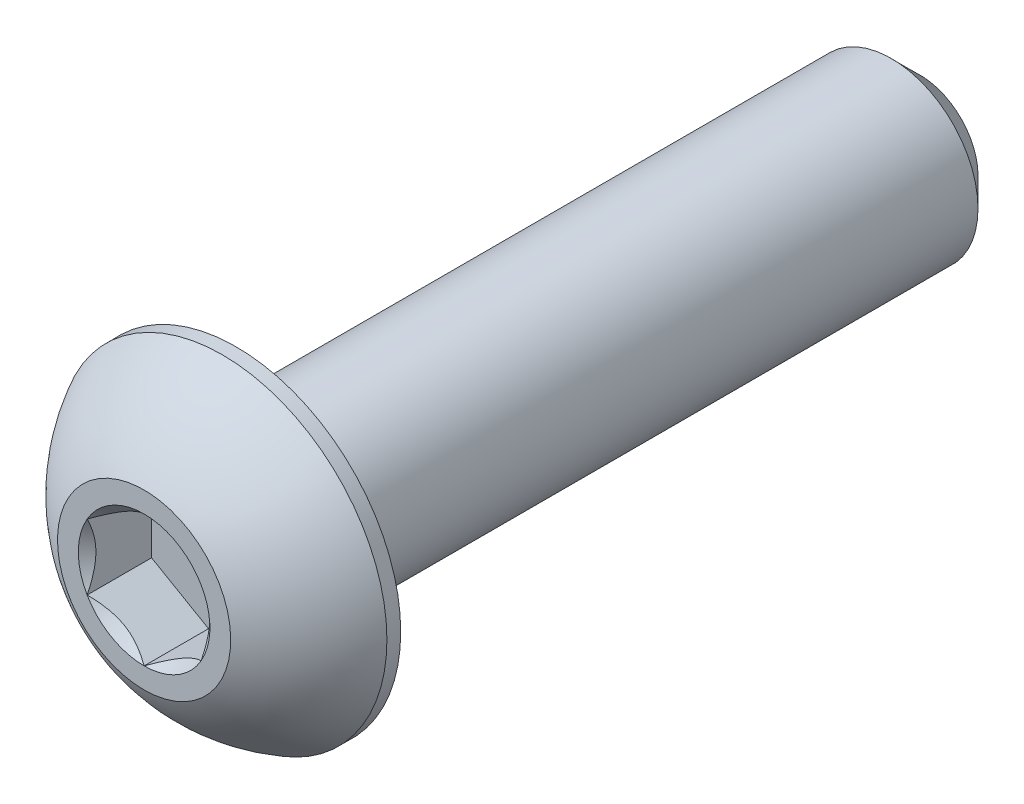
ISO-10303-21;
HEADER;
FILE_DESCRIPTION(('STEP AP214'),'2;1');
FILE_NAME('part.step','',(''),(''),'','','');
FILE_SCHEMA(('AUTOMOTIVE_DESIGN { 1 0 10303 214 1 1 1 1 }'));
ENDSEC;
DATA;
#1=APPLICATION_CONTEXT('core data for automotive mechanical design processes');
#2=APPLICATION_PROTOCOL_DEFINITION('international standard','automotive_design',2000,#1);
#3=PRODUCT_CONTEXT('',#1,'mechanical');
#4=PRODUCT('Part','Part','',(#3));
#5=PRODUCT_RELATED_PRODUCT_CATEGORY('part','',(#4));
#6=PRODUCT_DEFINITION_FORMATION('','',#4);
#7=PRODUCT_DEFINITION_CONTEXT('part definition',#1,'design');
#8=PRODUCT_DEFINITION('design','',#6,#7);
#9=PRODUCT_DEFINITION_SHAPE('','',#8);
#10=(LENGTH_UNIT() NAMED_UNIT(*) SI_UNIT(.MILLI.,.METRE.));
#11=(NAMED_UNIT(*) PLANE_ANGLE_UNIT() SI_UNIT($,.RADIAN.));
#12=(NAMED_UNIT(*) SI_UNIT($,.STERADIAN.) SOLID_ANGLE_UNIT());
#13=UNCERTAINTY_MEASURE_WITH_UNIT(LENGTH_MEASURE(1.E-05),#10,'distance_accuracy_value','');
#14=(GEOMETRIC_REPRESENTATION_CONTEXT(3) GLOBAL_UNCERTAINTY_ASSIGNED_CONTEXT((#13)) GLOBAL_UNIT_ASSIGNED_CONTEXT((#10,
#11,#12)) REPRESENTATION_CONTEXT('',''));
#15=CARTESIAN_POINT('',(0.,0.,0.));
#16=DIRECTION('',(0.,0.,1.));
#17=DIRECTION('',(1.,0.,0.));
#18=AXIS2_PLACEMENT_3D('',#15,#16,#17);
#19=CARTESIAN_POINT('',(0.,-2.413,-21.6154));
#20=DIRECTION('',(0.,0.,-1.));
#21=DIRECTION('',(0.,1.,0.));
#22=AXIS2_PLACEMENT_3D('',#19,#20,#21);
#23=PLANE('',#22);
#24=CARTESIAN_POINT('',(0.,0.,-21.6154));
#25=DIRECTION('',(0.,0.,-1.));
#26=DIRECTION('',(0.,1.,0.));
#27=AXIS2_PLACEMENT_3D('',#24,#25,#26);
#28=CIRCLE('',#27,1.61925);
#29=CARTESIAN_POINT('',(0.,-1.61925,-21.6154));
#30=VERTEX_POINT('',#29);
#31=EDGE_CURVE('E45',#30,#30,#28,.T.);
#32=ORIENTED_EDGE('',*,*,#31,.T.);
#33=EDGE_LOOP('',(#32));
#34=FACE_BOUND('',#33,.T.);
#35=ADVANCED_FACE('F37',(#34),#23,.T.);
#36=CARTESIAN_POINT('',(0.,0.,-21.6154));
#37=DIRECTION('',(0.,0.,-1.));
#38=DIRECTION('',(0.,1.,0.));
#39=AXIS2_PLACEMENT_3D('',#36,#37,#38);
#40=CYLINDRICAL_SURFACE('',#39,2.413);
#41=CARTESIAN_POINT('',(0.,0.,-20.82165));
#42=DIRECTION('',(0.,0.,-1.));
#43=DIRECTION('',(0.,1.,0.));
#44=AXIS2_PLACEMENT_3D('',#41,#42,#43);
#45=CIRCLE('',#44,2.413);
#46=CARTESIAN_POINT('',(0.,-2.41300000000001,-20.82165));
#47=VERTEX_POINT('',#46);
#48=EDGE_CURVE('E11',#47,#47,#45,.F.);
#49=ORIENTED_EDGE('',*,*,#48,.T.);
#50=EDGE_LOOP('',(#49));
#51=FACE_BOUND('',#50,.T.);
#52=CARTESIAN_POINT('',(0.,0.,-2.5654));
#53=DIRECTION('',(0.,0.,1.));
#54=DIRECTION('',(1.,0.,0.));
#55=AXIS2_PLACEMENT_3D('',#52,#53,#54);
#56=CIRCLE('',#55,2.413);
#57=CARTESIAN_POINT('',(2.413,0.,-2.5654));
#58=VERTEX_POINT('',#57);
#59=EDGE_CURVE('E171',#58,#58,#56,.F.);
#60=ORIENTED_EDGE('',*,*,#59,.T.);
#61=EDGE_LOOP('',(#60));
#62=FACE_BOUND('',#61,.T.);
#63=ADVANCED_FACE('F179',(#51,#62),#40,.T.);
#64=CARTESIAN_POINT('',(0.,0.,-21.6154));
#65=DIRECTION('',(0.,0.,1.));
#66=DIRECTION('',(0.,-1.,0.));
#67=AXIS2_PLACEMENT_3D('',#64,#65,#66);
#68=CONICAL_SURFACE('',#67,1.61925,0.785398163397449);
#69=CARTESIAN_POINT('',(0.,-2.41300000000001,-20.82165));
#70=CARTESIAN_POINT('',(0.,-2.40473177083334,-20.8299182291667));
#71=CARTESIAN_POINT('',(0.,-2.39646354166667,-20.8381864583333));
#72=CARTESIAN_POINT('',(0.,-2.37992708333334,-20.8547229166667));
#73=CARTESIAN_POINT('',(0.,-2.37165885416667,-20.8629911458333));
#74=CARTESIAN_POINT('',(0.,-2.35512239583334,-20.8795276041667));
#75=CARTESIAN_POINT('',(0.,-2.34685416666667,-20.8877958333333));
#76=CARTESIAN_POINT('',(0.,-2.33031770833334,-20.9043322916667));
#77=CARTESIAN_POINT('',(0.,-2.32204947916667,-20.9126005208333));
#78=CARTESIAN_POINT('',(0.,-2.30551302083334,-20.9291369791667));
#79=CARTESIAN_POINT('',(0.,-2.29724479166667,-20.9374052083333));
#80=CARTESIAN_POINT('',(0.,-2.28070833333334,-20.9539416666667));
#81=CARTESIAN_POINT('',(0.,-2.27244010416667,-20.9622098958333));
#82=CARTESIAN_POINT('',(0.,-2.25590364583334,-20.9787463541667));
#83=CARTESIAN_POINT('',(0.,-2.24763541666667,-20.9870145833333));
#84=CARTESIAN_POINT('',(0.,-2.23109895833334,-21.0035510416667));
#85=CARTESIAN_POINT('',(0.,-2.22283072916667,-21.0118192708333));
#86=CARTESIAN_POINT('',(0.,-2.20629427083334,-21.0283557291667));
#87=CARTESIAN_POINT('',(0.,-2.19802604166667,-21.0366239583333));
#88=CARTESIAN_POINT('',(0.,-2.18148958333334,-21.0531604166667));
#89=CARTESIAN_POINT('',(0.,-2.17322135416667,-21.0614286458333));
#90=CARTESIAN_POINT('',(0.,-2.15668489583334,-21.0779651041667));
#91=CARTESIAN_POINT('',(0.,-2.14841666666667,-21.0862333333333));
#92=CARTESIAN_POINT('',(0.,-2.13188020833334,-21.1027697916667));
#93=CARTESIAN_POINT('',(0.,-2.12361197916667,-21.1110380208333));
#94=CARTESIAN_POINT('',(0.,-2.10707552083334,-21.1275744791667));
#95=CARTESIAN_POINT('',(0.,-2.09880729166667,-21.1358427083333));
#96=CARTESIAN_POINT('',(0.,-2.08227083333334,-21.1523791666667));
#97=CARTESIAN_POINT('',(0.,-2.07400260416667,-21.1606473958333));
#98=CARTESIAN_POINT('',(0.,-2.05746614583334,-21.1771838541667));
#99=CARTESIAN_POINT('',(0.,-2.04919791666667,-21.1854520833333));
#100=CARTESIAN_POINT('',(0.,-2.03266145833334,-21.2019885416667));
#101=CARTESIAN_POINT('',(0.,-2.02439322916667,-21.2102567708333));
#102=CARTESIAN_POINT('',(0.,-2.00785677083334,-21.2267932291667));
#103=CARTESIAN_POINT('',(0.,-1.99958854166667,-21.2350614583333));
#104=CARTESIAN_POINT('',(0.,-1.98305208333334,-21.2515979166667));
#105=CARTESIAN_POINT('',(0.,-1.97478385416667,-21.2598661458333));
#106=CARTESIAN_POINT('',(0.,-1.95824739583334,-21.2764026041667));
#107=CARTESIAN_POINT('',(0.,-1.94997916666667,-21.2846708333333));
#108=CARTESIAN_POINT('',(0.,-1.93344270833334,-21.3012072916667));
#109=CARTESIAN_POINT('',(0.,-1.92517447916667,-21.3094755208333));
#110=CARTESIAN_POINT('',(0.,-1.90863802083334,-21.3260119791667));
#111=CARTESIAN_POINT('',(0.,-1.90036979166667,-21.3342802083333));
#112=CARTESIAN_POINT('',(0.,-1.88383333333334,-21.3508166666667));
#113=CARTESIAN_POINT('',(0.,-1.87556510416667,-21.3590848958333));
#114=CARTESIAN_POINT('',(0.,-1.85902864583334,-21.3756213541667));
#115=CARTESIAN_POINT('',(0.,-1.85076041666667,-21.3838895833333));
#116=CARTESIAN_POINT('',(0.,-1.83422395833334,-21.4004260416667));
#117=CARTESIAN_POINT('',(0.,-1.82595572916667,-21.4086942708333));
#118=CARTESIAN_POINT('',(0.,-1.80941927083334,-21.4252307291667));
#119=CARTESIAN_POINT('',(0.,-1.80115104166667,-21.4334989583333));
#120=CARTESIAN_POINT('',(0.,-1.78461458333334,-21.4500354166667));
#121=CARTESIAN_POINT('',(0.,-1.77634635416667,-21.4583036458333));
#122=CARTESIAN_POINT('',(0.,-1.75980989583334,-21.4748401041667));
#123=CARTESIAN_POINT('',(0.,-1.75154166666667,-21.4831083333333));
#124=CARTESIAN_POINT('',(0.,-1.73500520833334,-21.4996447916667));
#125=CARTESIAN_POINT('',(0.,-1.72673697916667,-21.5079130208333));
#126=CARTESIAN_POINT('',(0.,-1.71020052083334,-21.5244494791667));
#127=CARTESIAN_POINT('',(0.,-1.70193229166667,-21.5327177083333));
#128=CARTESIAN_POINT('',(0.,-1.68539583333333,-21.5492541666667));
#129=CARTESIAN_POINT('',(0.,-1.67712760416667,-21.5575223958333));
#130=CARTESIAN_POINT('',(0.,-1.66059114583334,-21.5740588541667));
#131=CARTESIAN_POINT('',(0.,-1.65232291666667,-21.5823270833333));
#132=CARTESIAN_POINT('',(0.,-1.63578645833334,-21.5988635416667));
#133=CARTESIAN_POINT('',(0.,-1.62751822916667,-21.6071317708333));
#134=CARTESIAN_POINT('',(0.,-1.61925,-21.6154));
#135=B_SPLINE_CURVE_WITH_KNOTS('',3,(#69,#70,#71,#72,#73,#74,#75,#76,#77,#78,#79,#80,#81,#82,
#83,#84,#85,#86,#87,#88,#89,#90,#91,#92,#93,#94,#95,#96,#97,#98,#99,#100,#101,#102,#103,#104,
#105,#106,#107,#108,#109,#110,#111,#112,#113,#114,#115,#116,#117,#118,#119,#120,#121,#122,#123,
#124,#125,#126,#127,#128,#129,#130,#131,#132,#133,#134),.UNSPECIFIED.,.F.,.F.,(4,2,2,2,2,2,2,2,
2,2,2,2,2,2,2,2,2,2,2,2,2,2,2,2,2,2,2,2,2,2,2,2,4),(0.,0.0350791254729271,0.0701582509458542,
0.105237376418782,0.140316501891707,0.175395627364634,0.210474752837561,0.245553878310486,
0.280633003783413,0.315712129256341,0.350791254729265,0.385870380202193,0.42094950567512,
0.456028631148045,0.491107756620972,0.526186882093899,0.561266007566824,0.596345133039751,
0.631424258512679,0.666503383985606,0.701582509458531,0.736661634931458,0.771740760404385,
0.80681988587731,0.841899011350238,0.876978136823165,0.91205726229609,0.947136387769017,
0.982215513241944,1.01729463871487,1.0523737641878,1.08745288966072,1.12253201513365),.UNSPECIFIED.);
#136=EDGE_CURVE('BSEAM39',#47,#30,#135,.T.);
#137=ORIENTED_EDGE('',*,*,#48,.F.);
#138=ORIENTED_EDGE('',*,*,#31,.F.);
#139=ORIENTED_EDGE('',*,*,#136,.T.);
#140=ORIENTED_EDGE('',*,*,#136,.F.);
#141=EDGE_LOOP('',(#137,#139,#138,#140));
#142=FACE_BOUND('',#141,.T.);
#143=ADVANCED_FACE('F39',(#142),#68,.T.);
#144=CARTESIAN_POINT('',(0.,0.,-4.5748806144438));
#145=DIRECTION('',(0.,0.,1.));
#146=DIRECTION('',(0.,-1.,0.));
#147=AXIS2_PLACEMENT_3D('',#144,#145,#146);
#148=SPHERICAL_SURFACE('',#147,5.17224338526463);
#149=CARTESIAN_POINT('',(0.,0.,0.));
#150=DIRECTION('',(0.,0.,1.));
#151=DIRECTION('',(1.,0.,0.));
#152=AXIS2_PLACEMENT_3D('',#149,#150,#151);
#153=CIRCLE('',#152,2.413);
#154=CARTESIAN_POINT('',(0.,-2.413,0.));
#155=VERTEX_POINT('',#154);
#156=EDGE_CURVE('E168',#155,#155,#153,.T.);
#157=CARTESIAN_POINT('',(0.,0.,-2.18059));
#158=DIRECTION('',(0.,0.,1.));
#159=DIRECTION('',(1.,0.,0.));
#160=AXIS2_PLACEMENT_3D('',#157,#158,#159);
#161=CIRCLE('',#160,4.5847);
#162=CARTESIAN_POINT('',(0.,-4.5847,-2.18059));
#163=VERTEX_POINT('',#162);
#164=EDGE_CURVE('E162',#163,#163,#161,.T.);
#165=CARTESIAN_POINT('',(0.,-2.413,0.));
#166=CARTESIAN_POINT('',(0.,-2.44179113663083,-0.0151857097788009));
#167=CARTESIAN_POINT('',(0.,-2.47043888331474,-0.0306432741933343));
#168=CARTESIAN_POINT('',(0.,-2.5274374690351,-0.0620964513369402));
#169=CARTESIAN_POINT('',(0.,-2.55578830807155,-0.0780920640660127));
#170=CARTESIAN_POINT('',(0.,-2.61218295074331,-0.110615676881771));
#171=CARTESIAN_POINT('',(0.,-2.64022675437863,-0.127143676968457));
#172=CARTESIAN_POINT('',(0.,-2.69599733629138,-0.160726162390165));
#173=CARTESIAN_POINT('',(0.,-2.72372411456883,-0.177780647725188));
#174=CARTESIAN_POINT('',(0.,-2.77885076121155,-0.21241002764294));
#175=CARTESIAN_POINT('',(0.,-2.80625062957682,-0.229984922225668));
#176=CARTESIAN_POINT('',(0.,-2.86071369040082,-0.265648855453746));
#177=CARTESIAN_POINT('',(0.,-2.88777688285954,-0.283737894099096));
#178=CARTESIAN_POINT('',(0.,-2.94155694533546,-0.320423667994127));
#179=CARTESIAN_POINT('',(0.,-2.96827381535266,-0.339020403243808));
#180=CARTESIAN_POINT('',(0.,-3.02135171000009,-0.37671494166065));
#181=CARTESIAN_POINT('',(0.,-3.04771273463033,-0.39581274482781));
#182=CARTESIAN_POINT('',(0.,-3.10006954235699,-0.434502611862808));
#183=CARTESIAN_POINT('',(0.,-3.12606532545341,-0.454094675730644));
#184=CARTESIAN_POINT('',(0.,-3.17768238416296,-0.493766080756604));
#185=CARTESIAN_POINT('',(0.,-3.20330365977609,-0.513845421914727));
#186=CARTESIAN_POINT('',(0.,-3.25416257105645,-0.554484224430573));
#187=CARTESIAN_POINT('',(0.,-3.27940020672367,-0.575043685788297));
#188=CARTESIAN_POINT('',(0.,-3.32948284239517,-0.616635400476975));
#189=CARTESIAN_POINT('',(0.,-3.35432784239946,-0.63766765380793));
#190=CARTESIAN_POINT('',(0.,-3.40361635097913,-0.680197455694829));
#191=CARTESIAN_POINT('',(0.,-3.42805985955453,-0.701695004250773));
#192=CARTESIAN_POINT('',(0.,-3.47653667261836,-0.745147733989217));
#193=CARTESIAN_POINT('',(0.,-3.5005699771068,-0.767102915171716));
#194=CARTESIAN_POINT('',(0.,-3.54821781555203,-0.81146308444603));
#195=CARTESIAN_POINT('',(0.,-3.57183234950881,-0.833868072537843));
#196=CARTESIAN_POINT('',(0.,-3.61863422971284,-0.879119869584105));
#197=CARTESIAN_POINT('',(0.,-3.64182157596008,-0.901966678538555));
#198=CARTESIAN_POINT('',(0.,-3.68776081583415,-0.948093973780533));
#199=CARTESIAN_POINT('',(0.,-3.71051270946098,-0.971374460068061));
#200=CARTESIAN_POINT('',(0.,-3.75557293439636,-1.01836081186645));
#201=CARTESIAN_POINT('',(0.,-3.7778812657049,-1.0420666773773));
#202=CARTESIAN_POINT('',(0.,-3.82204641440941,-1.08989533789018));
#203=CARTESIAN_POINT('',(0.,-3.84390323180538,-1.11401813289221));
#204=CARTESIAN_POINT('',(0.,-3.88715756202836,-1.16267205404467));
#205=CARTESIAN_POINT('',(0.,-3.90855507485536,-1.18720318019511));
#206=CARTESIAN_POINT('',(0.,-3.95088316899876,-1.23666501975588));
#207=CARTESIAN_POINT('',(0.,-3.97181375031515,-1.26159573316622));
#208=CARTESIAN_POINT('',(0.,-4.01320052092912,-1.31184786092909));
#209=CARTESIAN_POINT('',(0.,-4.03365671022669,-1.33716927528163));
#210=CARTESIAN_POINT('',(0.,-4.07408740538699,-1.38819377934977));
#211=CARTESIAN_POINT('',(0.,-4.09406191124973,-1.41389686906536));
#212=CARTESIAN_POINT('',(0.,-4.13352211981722,-1.46567556223513));
#213=CARTESIAN_POINT('',(0.,-4.15300782252198,-1.4917511656893));
#214=CARTESIAN_POINT('',(0.,-4.19148347927457,-1.54426559193551));
#215=CARTESIAN_POINT('',(0.,-4.2104734333224,-1.57070441472756));
#216=CARTESIAN_POINT('',(0.,-4.24795082398615,-1.6239358557723));
#217=CARTESIAN_POINT('',(0.,-4.26643826060207,-1.65072847402499));
#218=CARTESIAN_POINT('',(0.,-4.30290402667351,-1.70465795604563));
#219=CARTESIAN_POINT('',(0.,-4.32088235612901,-1.73179481981358));
#220=CARTESIAN_POINT('',(0.,-4.35632349988304,-1.78640312007115));
#221=CARTESIAN_POINT('',(0.,-4.37378631418156,-1.81387455656079));
#222=CARTESIAN_POINT('',(0.,-4.40819020238474,-1.86914221075438));
#223=CARTESIAN_POINT('',(0.,-4.42513127628939,-1.89693842845834));
#224=CARTESIAN_POINT('',(0.,-4.45848564813517,-1.95284573578717));
#225=CARTESIAN_POINT('',(0.,-4.4748989460763,-1.98095682541204));
#226=CARTESIAN_POINT('',(0.,-4.50719190474587,-2.03748386259807));
#227=CARTESIAN_POINT('',(0.,-4.5230715654743,-2.06589981015923));
#228=CARTESIAN_POINT('',(0.,-4.55429163018258,-2.12302641242262));
#229=CARTESIAN_POINT('',(0.,-4.56963203416241,-2.15173706712485));
#230=CARTESIAN_POINT('',(0.,-4.5847,-2.18059));
#231=B_SPLINE_CURVE_WITH_KNOTS('',3,(#165,#166,#167,#168,#169,#170,#171,#172,#173,#174,#175,
#176,#177,#178,#179,#180,#181,#182,#183,#184,#185,#186,#187,#188,#189,#190,#191,#192,#193,#194,
#195,#196,#197,#198,#199,#200,#201,#202,#203,#204,#205,#206,#207,#208,#209,#210,#211,#212,#213,
#214,#215,#216,#217,#218,#219,#220,#221,#222,#223,#224,#225,#226,#227,#228,#229,#230),
.UNSPECIFIED.,.F.,.F.,(4,2,2,2,2,2,2,2,2,2,2,2,2,2,2,2,2,2,2,2,2,2,2,2,2,2,2,2,2,2,2,2,4),(0.,
0.0976500604051489,0.195300120810298,0.292950181215447,0.390600241620598,0.488250302025747,
0.585900362430896,0.683550422836046,0.781200483241194,0.878850543646344,0.976500604051493,
1.07415066445664,1.17180072486179,1.26945078526694,1.36710084567209,1.46475090607724,
1.56240096648239,1.66005102688754,1.75770108729269,1.85535114769784,1.95300120810299,
2.05065126850813,2.14830132891329,2.24595138931843,2.34360144972358,2.44125151012873,
2.53890157053388,2.63655163093903,2.73420169134418,2.83185175174933,2.92950181215448,
3.02715187255963,3.12480193296478),.UNSPECIFIED.);
#232=EDGE_CURVE('BSEAM178',#155,#163,#231,.T.);
#233=ORIENTED_EDGE('',*,*,#156,.F.);
#234=ORIENTED_EDGE('',*,*,#164,.T.);
#235=ORIENTED_EDGE('',*,*,#232,.T.);
#236=ORIENTED_EDGE('',*,*,#232,.F.);
#237=EDGE_LOOP('',(#233,#235,#234,#236));
#238=FACE_BOUND('',#237,.T.);
#239=ADVANCED_FACE('F178',(#238),#148,.T.);
#240=CARTESIAN_POINT('',(0.,-2.413,0.));
#241=DIRECTION('',(0.,0.,-1.));
#242=DIRECTION('',(-1.,0.,0.));
#243=AXIS2_PLACEMENT_3D('',#240,#241,#242);
#244=PLANE('',#243);
#245=CARTESIAN_POINT('',(0.,0.,0.));
#246=DIRECTION('',(0.,0.,1.));
#247=DIRECTION('',(1.,0.,0.));
#248=AXIS2_PLACEMENT_3D('',#245,#246,#247);
#249=CIRCLE('',#248,1.83308710467706);
#250=CARTESIAN_POINT('',(-1.5875,0.91654355233853,0.));
#251=VERTEX_POINT('',#250);
#252=CARTESIAN_POINT('',(-1.5875,-0.916543552338532,0.));
#253=VERTEX_POINT('',#252);
#254=EDGE_CURVE('E58',#251,#253,#249,.T.);
#255=ORIENTED_EDGE('',*,*,#254,.F.);
#256=CARTESIAN_POINT('',(0.,1.83308710467706,0.));
#257=VERTEX_POINT('',#256);
#258=EDGE_CURVE('E132',#257,#251,#249,.T.);
#259=ORIENTED_EDGE('',*,*,#258,.F.);
#260=CARTESIAN_POINT('',(1.5875,0.916543552338532,0.));
#261=VERTEX_POINT('',#260);
#262=EDGE_CURVE('E109',#261,#257,#249,.T.);
#263=ORIENTED_EDGE('',*,*,#262,.F.);
#264=CARTESIAN_POINT('',(1.5875,-0.916543552338532,0.));
#265=VERTEX_POINT('',#264);
#266=EDGE_CURVE('E98',#265,#261,#249,.T.);
#267=ORIENTED_EDGE('',*,*,#266,.F.);
#268=CARTESIAN_POINT('',(0.,-1.83308710467706,0.));
#269=VERTEX_POINT('',#268);
#270=EDGE_CURVE('E90',#269,#265,#249,.T.);
#271=ORIENTED_EDGE('',*,*,#270,.F.);
#272=EDGE_CURVE('E51',#253,#269,#249,.T.);
#273=ORIENTED_EDGE('',*,*,#272,.F.);
#274=EDGE_LOOP('',(#255,#259,#263,#267,#271,#273));
#275=FACE_BOUND('',#274,.T.);
#276=ORIENTED_EDGE('',*,*,#156,.T.);
#277=EDGE_LOOP('',(#276));
#278=FACE_BOUND('',#277,.T.);
#279=ADVANCED_FACE('F129',(#275,#278),#244,.F.);
#280=CARTESIAN_POINT('',(0.,-4.5847,-2.5654));
#281=DIRECTION('',(0.,0.,1.));
#282=DIRECTION('',(1.,0.,0.));
#283=AXIS2_PLACEMENT_3D('',#280,#281,#282);
#284=PLANE('',#283);
#285=ORIENTED_EDGE('',*,*,#59,.F.);
#286=EDGE_LOOP('',(#285));
#287=FACE_BOUND('',#286,.T.);
#288=CARTESIAN_POINT('',(0.,0.,-2.5654));
#289=DIRECTION('',(0.,0.,1.));
#290=DIRECTION('',(1.,0.,0.));
#291=AXIS2_PLACEMENT_3D('',#288,#289,#290);
#292=CIRCLE('',#291,4.5847);
#293=CARTESIAN_POINT('',(4.5847,0.,-2.5654));
#294=VERTEX_POINT('',#293);
#295=EDGE_CURVE('E165',#294,#294,#292,.T.);
#296=ORIENTED_EDGE('',*,*,#295,.F.);
#297=EDGE_LOOP('',(#296));
#298=FACE_BOUND('',#297,.T.);
#299=ADVANCED_FACE('F196',(#287,#298),#284,.F.);
#300=CARTESIAN_POINT('',(0.,0.,0.));
#301=DIRECTION('',(0.,0.,1.));
#302=DIRECTION('',(1.,0.,0.));
#303=AXIS2_PLACEMENT_3D('',#300,#301,#302);
#304=CYLINDRICAL_SURFACE('',#303,4.5847);
#305=ORIENTED_EDGE('',*,*,#164,.F.);
#306=EDGE_LOOP('',(#305));
#307=FACE_BOUND('',#306,.T.);
#308=ORIENTED_EDGE('',*,*,#295,.T.);
#309=EDGE_LOOP('',(#308));
#310=FACE_BOUND('',#309,.T.);
#311=ADVANCED_FACE('F199',(#307,#310),#304,.T.);
#312=CARTESIAN_POINT('',(0.,0.,0.));
#313=DIRECTION('',(0.,0.,1.));
#314=DIRECTION('',(1.,0.,0.));
#315=AXIS2_PLACEMENT_3D('',#312,#313,#314);
#316=CONICAL_SURFACE('',#315,1.83308710467706,0.78539816339745);
#317=ORIENTED_EDGE('',*,*,#266,.T.);
#318=CARTESIAN_POINT('',(1.5875,-1.83163614232865,0.590762562254564));
#319=CARTESIAN_POINT('',(1.5875,-1.78705354844902,0.55707785480324));
#320=CARTESIAN_POINT('',(1.5875,-1.74222294150555,0.523722329968627));
#321=CARTESIAN_POINT('',(1.5875,-1.65196486784504,0.457805675888285));
#322=CARTESIAN_POINT('',(1.5875,-1.60653725449665,0.425244747634468));
#323=CARTESIAN_POINT('',(1.5875,-1.46854281940082,0.328493449461236));
#324=CARTESIAN_POINT('',(1.5875,-1.37494211623386,0.265753264612857));
#325=CARTESIAN_POINT('',(1.5875,-1.17864136265695,0.142553151294644));
#326=CARTESIAN_POINT('',(1.5875,-1.07572731596385,0.0824303289226484));
#327=CARTESIAN_POINT('',(1.5875,-0.864754189558117,-0.0275706334490083));
#328=CARTESIAN_POINT('',(1.5875,-0.756714033301438,-0.0774833149376719));
#329=CARTESIAN_POINT('',(1.5875,-0.594580029688666,-0.138547963751185));
#330=CARTESIAN_POINT('',(1.5875,-0.542894373932898,-0.156067797502568));
#331=CARTESIAN_POINT('',(1.5875,-0.43827206291756,-0.186958420156953));
#332=CARTESIAN_POINT('',(1.5875,-0.3853353220534,-0.200328924255393));
#333=CARTESIAN_POINT('',(1.5875,-0.27941340073437,-0.222002681044568));
#334=CARTESIAN_POINT('',(1.5875,-0.226446313904206,-0.230392976800141));
#335=CARTESIAN_POINT('',(1.5875,-0.119941637592404,-0.241941911012322));
#336=CARTESIAN_POINT('',(1.5875,-0.0664041486263234,-0.245101456366562));
#337=CARTESIAN_POINT('',(1.5875,0.0387581192420278,-0.245952982965122));
#338=CARTESIAN_POINT('',(1.5875,0.090381381554216,-0.243840334608509));
#339=CARTESIAN_POINT('',(1.5875,0.193187302016829,-0.234695846678065));
#340=CARTESIAN_POINT('',(1.5875,0.244369916988516,-0.227663530460197));
#341=CARTESIAN_POINT('',(1.5875,0.346790527788956,-0.208944949355169));
#342=CARTESIAN_POINT('',(1.5875,0.398013804172139,-0.197179358640978));
#343=CARTESIAN_POINT('',(1.5875,0.499340680307276,-0.169620657149213));
#344=CARTESIAN_POINT('',(1.5875,0.549444372105894,-0.153827878801824));
#345=CARTESIAN_POINT('',(1.5875,0.707022639586407,-0.098213379071742));
#346=CARTESIAN_POINT('',(1.5875,0.812258737570578,-0.0520647672653372));
#347=CARTESIAN_POINT('',(1.5875,1.01778869013701,0.0505458403808818));
#348=CARTESIAN_POINT('',(1.5875,1.11806310933256,0.107044855107552));
#349=CARTESIAN_POINT('',(1.5875,1.30970442577157,0.223612502972616));
#350=CARTESIAN_POINT('',(1.5875,1.40126637149297,0.283364441978612));
#351=CARTESIAN_POINT('',(1.5875,1.53616443073864,0.375737008691709));
#352=CARTESIAN_POINT('',(1.5875,1.58054835823549,0.406854014274727));
#353=CARTESIAN_POINT('',(1.5875,1.66870952512132,0.469911550181165));
#354=CARTESIAN_POINT('',(1.5875,1.71248692801697,0.50185185164746));
#355=CARTESIAN_POINT('',(1.5875,1.75601179240957,0.534133557847129));
#356=B_SPLINE_CURVE_WITH_KNOTS('',3,(#318,#319,#320,#321,#322,#323,#324,#325,#326,#327,#328,
#329,#330,#331,#332,#333,#334,#335,#336,#337,#338,#339,#340,#341,#342,#343,#344,#345,#346,#347,
#348,#349,#350,#351,#352,#353,#354,#355),.UNSPECIFIED.,.F.,.F.,(4,2,2,2,2,2,2,2,2,2,2,2,2,2,2,2,
2,2,4),(0.,0.167627505127548,0.33529698084648,0.673194674702938,1.0304700708717,
1.38651603079307,1.55010049300858,1.71369618096554,1.87434127467533,2.034958513124,
2.18971280484453,2.34448209207484,2.50196108385089,2.65942708049529,3.00314617711216,
3.34811949873714,3.6759579216973,3.83856722085481,4.00113179576279),.UNSPECIFIED.);
#357=EDGE_CURVE('E103',#265,#261,#356,.T.);
#358=ORIENTED_EDGE('',*,*,#357,.F.);
#359=EDGE_LOOP('',(#317,#358));
#360=FACE_BOUND('',#359,.T.);
#361=ADVANCED_FACE('F104',(#360),#316,.F.);
#362=ORIENTED_EDGE('',*,*,#262,.T.);
#363=CARTESIAN_POINT('',(1.5877,0.916428082284693,0.000115480963706531));
#364=CARTESIAN_POINT('',(1.53312479190086,0.947937093371809,-0.0313691916294032));
#365=CARTESIAN_POINT('',(1.47763696320971,0.979973006203395,-0.0610049539864701));
#366=CARTESIAN_POINT('',(1.36449087915364,1.04529792829092,-0.115267739979175));
#367=CARTESIAN_POINT('',(1.30682185887062,1.07859315267522,-0.139864564866824));
#368=CARTESIAN_POINT('',(1.1905349781269,1.14573141457583,-0.181999635727418));
#369=CARTESIAN_POINT('',(1.13194674474407,1.17955734689075,-0.199643807270178));
#370=CARTESIAN_POINT('',(1.01348022674557,1.24795402294714,-0.226828529915032));
#371=CARTESIAN_POINT('',(0.953605562983895,1.28252267618758,-0.236389379304923));
#372=CARTESIAN_POINT('',(0.850418771876558,1.34209759781022,-0.245015586895992));
#373=CARTESIAN_POINT('',(0.807240015952288,1.36702686416637,-0.246292807190424));
#374=CARTESIAN_POINT('',(0.720953038535399,1.41684467380557,-0.244142944185296));
#375=CARTESIAN_POINT('',(0.677844847078612,1.44173319974742,-0.240714211450657));
#376=CARTESIAN_POINT('',(0.592046335002031,1.49126899379091,-0.229349005566657));
#377=CARTESIAN_POINT('',(0.549356408925407,1.51591603410293,-0.221408628198359));
#378=CARTESIAN_POINT('',(0.464693063478359,1.56479643938728,-0.201451585548899));
#379=CARTESIAN_POINT('',(0.422719959755075,1.58902962212064,-0.18943317079131));
#380=CARTESIAN_POINT('',(0.315211458113567,1.65109968448354,-0.153753102752755));
#381=CARTESIAN_POINT('',(0.250342771708901,1.68855163804125,-0.127401427696864));
#382=CARTESIAN_POINT('',(0.154961599380924,1.74361998356043,-0.0829164631482983));
#383=CARTESIAN_POINT('',(0.123530699536157,1.76176662204668,-0.0672871421988688));
#384=CARTESIAN_POINT('',(0.0612469855696368,1.79772614107138,-0.0346015121388989));
#385=CARTESIAN_POINT('',(0.0303939039605763,1.8155391760437,-0.0175458843430304));
#386=CARTESIAN_POINT('',(-0.000200000000000464,1.8332025747309,0.000115480963706542));
#387=B_SPLINE_CURVE_WITH_KNOTS('',3,(#363,#364,#365,#366,#367,#368,#369,#370,#371,#372,#373,
#374,#375,#376,#377,#378,#379,#380,#381,#382,#383,#384,#385,#386),.UNSPECIFIED.,.F.,.F.,(4,2,2,
2,2,2,2,2,2,2,2,4),(0.,0.211482650810816,0.424197870807275,0.633533884524815,0.842342653263348,
0.991755553727141,1.14122083674204,1.29081565918877,1.44047473906437,1.6781878086972,
1.79671410024894,1.91518409436631),.UNSPECIFIED.);
#388=EDGE_CURVE('E108',#261,#257,#387,.T.);
#389=ORIENTED_EDGE('',*,*,#388,.F.);
#390=EDGE_LOOP('',(#362,#389));
#391=FACE_BOUND('',#390,.T.);
#392=ADVANCED_FACE('F290',(#391),#316,.F.);
#393=ORIENTED_EDGE('',*,*,#258,.T.);
#394=CARTESIAN_POINT('',(0.000199999999999433,1.8332025747309,0.000115480963706792));
#395=CARTESIAN_POINT('',(-0.0543752080991369,1.80169356364378,-0.0313691916294032));
#396=CARTESIAN_POINT('',(-0.10986303679029,1.7696576508122,-0.0610049539864701));
#397=CARTESIAN_POINT('',(-0.223009120846359,1.70433272872467,-0.115267739979175));
#398=CARTESIAN_POINT('',(-0.280678141129381,1.67103750434037,-0.139864564866824));
#399=CARTESIAN_POINT('',(-0.396965021873103,1.60389924243976,-0.181999635727418));
#400=CARTESIAN_POINT('',(-0.455553255255931,1.57007331012484,-0.199643807270178));
#401=CARTESIAN_POINT('',(-0.574019773254431,1.50167663406845,-0.226828529915031));
#402=CARTESIAN_POINT('',(-0.633894437016105,1.46710798082801,-0.236389379304923));
#403=CARTESIAN_POINT('',(-0.737081228123442,1.40753305920537,-0.245015586895992));
#404=CARTESIAN_POINT('',(-0.780259984047712,1.38260379284922,-0.246292807190424));
#405=CARTESIAN_POINT('',(-0.866546961464601,1.33278598321002,-0.244142944185296));
#406=CARTESIAN_POINT('',(-0.909655152921388,1.30789745726817,-0.240714211450657));
#407=CARTESIAN_POINT('',(-0.995453664997969,1.25836166322468,-0.229349005566657));
#408=CARTESIAN_POINT('',(-1.03814359107459,1.23371462291266,-0.221408628198359));
#409=CARTESIAN_POINT('',(-1.12280693652164,1.18483421762831,-0.201451585548899));
#410=CARTESIAN_POINT('',(-1.16478004024492,1.16060103489495,-0.18943317079131));
#411=CARTESIAN_POINT('',(-1.27228854188643,1.09853097253205,-0.153753102752755));
#412=CARTESIAN_POINT('',(-1.3371572282911,1.06107901897434,-0.127401427696864));
#413=CARTESIAN_POINT('',(-1.43253840061908,1.00601067345516,-0.0829164631482985));
#414=CARTESIAN_POINT('',(-1.46396930046384,0.987864034968914,-0.067287142198869));
#415=CARTESIAN_POINT('',(-1.52625301443036,0.951904515944214,-0.0346015121388991));
#416=CARTESIAN_POINT('',(-1.55710609603942,0.934091480971893,-0.0175458843430306));
#417=CARTESIAN_POINT('',(-1.5877,0.916428082284692,0.000115480963706121));
#418=B_SPLINE_CURVE_WITH_KNOTS('',3,(#394,#395,#396,#397,#398,#399,#400,#401,#402,#403,#404,
#405,#406,#407,#408,#409,#410,#411,#412,#413,#414,#415,#416,#417),.UNSPECIFIED.,.F.,.F.,(4,2,2,
2,2,2,2,2,2,2,2,4),(0.,0.211482650810816,0.424197870807276,0.633533884524815,0.842342653263348,
0.99175555372714,1.14122083674204,1.29081565918877,1.44047473906437,1.6781878086972,
1.79671410024894,1.91518409436631),.UNSPECIFIED.);
#419=EDGE_CURVE('E139',#257,#251,#418,.T.);
#420=ORIENTED_EDGE('',*,*,#419,.F.);
#421=EDGE_LOOP('',(#393,#420));
#422=FACE_BOUND('',#421,.T.);
#423=ADVANCED_FACE('F137',(#422),#316,.F.);
#424=ORIENTED_EDGE('',*,*,#254,.T.);
#425=CARTESIAN_POINT('',(-1.5875,-1.83163614232865,0.590762562254564));
#426=CARTESIAN_POINT('',(-1.5875,-1.78705354844902,0.557077854803239));
#427=CARTESIAN_POINT('',(-1.5875,-1.74222294150555,0.523722329968626));
#428=CARTESIAN_POINT('',(-1.5875,-1.65196486784504,0.457805675888284));
#429=CARTESIAN_POINT('',(-1.5875,-1.60653725449665,0.425244747634467));
#430=CARTESIAN_POINT('',(-1.5875,-1.46854281940082,0.328493449461235));
#431=CARTESIAN_POINT('',(-1.5875,-1.37494211623386,0.265753264612857));
#432=CARTESIAN_POINT('',(-1.5875,-1.17864136265695,0.142553151294644));
#433=CARTESIAN_POINT('',(-1.5875,-1.07572731596385,0.0824303289226479));
#434=CARTESIAN_POINT('',(-1.5875,-0.864754189558117,-0.0275706334490087));
#435=CARTESIAN_POINT('',(-1.5875,-0.756714033301438,-0.0774833149376723));
#436=CARTESIAN_POINT('',(-1.5875,-0.594580029688666,-0.138547963751186));
#437=CARTESIAN_POINT('',(-1.5875,-0.542894373932898,-0.156067797502569));
#438=CARTESIAN_POINT('',(-1.5875,-0.438272062917561,-0.186958420156954));
#439=CARTESIAN_POINT('',(-1.5875,-0.385335322053401,-0.200328924255393));
#440=CARTESIAN_POINT('',(-1.5875,-0.27941340073437,-0.222002681044568));
#441=CARTESIAN_POINT('',(-1.5875,-0.226446313904207,-0.230392976800141));
#442=CARTESIAN_POINT('',(-1.5875,-0.119941637592405,-0.241941911012323));
#443=CARTESIAN_POINT('',(-1.5875,-0.0664041486263242,-0.245101456366563));
#444=CARTESIAN_POINT('',(-1.5875,0.038758119242027,-0.245952982965123));
#445=CARTESIAN_POINT('',(-1.5875,0.0903813815542152,-0.24384033460851));
#446=CARTESIAN_POINT('',(-1.5875,0.193187302016829,-0.234695846678066));
#447=CARTESIAN_POINT('',(-1.5875,0.244369916988516,-0.227663530460198));
#448=CARTESIAN_POINT('',(-1.5875,0.346790527788956,-0.208944949355169));
#449=CARTESIAN_POINT('',(-1.5875,0.398013804172138,-0.197179358640978));
#450=CARTESIAN_POINT('',(-1.5875,0.499340680307276,-0.169620657149213));
#451=CARTESIAN_POINT('',(-1.5875,0.549444372105893,-0.153827878801825));
#452=CARTESIAN_POINT('',(-1.5875,0.707022639586407,-0.0982133790717427));
#453=CARTESIAN_POINT('',(-1.5875,0.812258737570577,-0.0520647672653375));
#454=CARTESIAN_POINT('',(-1.5875,1.01778869013701,0.0505458403808819));
#455=CARTESIAN_POINT('',(-1.5875,1.11806310933256,0.107044855107552));
#456=CARTESIAN_POINT('',(-1.5875,1.30970442577157,0.223612502972616));
#457=CARTESIAN_POINT('',(-1.5875,1.40126637149297,0.283364441978612));
#458=CARTESIAN_POINT('',(-1.5875,1.53616443073864,0.375737008691709));
#459=CARTESIAN_POINT('',(-1.5875,1.58054835823549,0.406854014274728));
#460=CARTESIAN_POINT('',(-1.5875,1.66870952512132,0.469911550181165));
#461=CARTESIAN_POINT('',(-1.5875,1.71248692801697,0.501851851647461));
#462=CARTESIAN_POINT('',(-1.5875,1.75601179240957,0.53413355784713));
#463=B_SPLINE_CURVE_WITH_KNOTS('',3,(#425,#426,#427,#428,#429,#430,#431,#432,#433,#434,#435,
#436,#437,#438,#439,#440,#441,#442,#443,#444,#445,#446,#447,#448,#449,#450,#451,#452,#453,#454,
#455,#456,#457,#458,#459,#460,#461,#462),.UNSPECIFIED.,.F.,.F.,(4,2,2,2,2,2,2,2,2,2,2,2,2,2,2,2,
2,2,4),(0.,0.167627505127548,0.335296980846479,0.673194674702937,1.0304700708717,
1.38651603079307,1.55010049300858,1.71369618096554,1.87434127467533,2.034958513124,
2.18971280484453,2.34448209207484,2.50196108385089,2.65942708049529,3.00314617711216,
3.34811949873714,3.67595792169729,3.83856722085481,4.00113179576279),.UNSPECIFIED.);
#464=EDGE_CURVE('E143',#251,#253,#463,.F.);
#465=ORIENTED_EDGE('',*,*,#464,.F.);
#466=EDGE_LOOP('',(#424,#465));
#467=FACE_BOUND('',#466,.T.);
#468=ADVANCED_FACE('F284',(#467),#316,.F.);
#469=ORIENTED_EDGE('',*,*,#272,.T.);
#470=CARTESIAN_POINT('',(-1.5877,-0.916428082284693,0.000115480963706097));
#471=CARTESIAN_POINT('',(-1.53312479190086,-0.947937093371809,-0.0313691916294036));
#472=CARTESIAN_POINT('',(-1.47763696320971,-0.979973006203395,-0.0610049539864704));
#473=CARTESIAN_POINT('',(-1.36449087915364,-1.04529792829092,-0.115267739979175));
#474=CARTESIAN_POINT('',(-1.30682185887062,-1.07859315267522,-0.139864564866824));
#475=CARTESIAN_POINT('',(-1.1905349781269,-1.14573141457583,-0.181999635727418));
#476=CARTESIAN_POINT('',(-1.13194674474407,-1.17955734689075,-0.199643807270178));
#477=CARTESIAN_POINT('',(-1.01348022674557,-1.24795402294714,-0.226828529915032));
#478=CARTESIAN_POINT('',(-0.953605562983896,-1.28252267618758,-0.236389379304923));
#479=CARTESIAN_POINT('',(-0.850418771876558,-1.34209759781022,-0.245015586895992));
#480=CARTESIAN_POINT('',(-0.807240015952288,-1.36702686416637,-0.246292807190424));
#481=CARTESIAN_POINT('',(-0.720953038535399,-1.41684467380557,-0.244142944185296));
#482=CARTESIAN_POINT('',(-0.677844847078613,-1.44173319974742,-0.240714211450657));
#483=CARTESIAN_POINT('',(-0.592046335002032,-1.49126899379091,-0.229349005566657));
#484=CARTESIAN_POINT('',(-0.549356408925407,-1.51591603410293,-0.221408628198359));
#485=CARTESIAN_POINT('',(-0.46469306347836,-1.56479643938728,-0.201451585548899));
#486=CARTESIAN_POINT('',(-0.422719959755076,-1.58902962212064,-0.18943317079131));
#487=CARTESIAN_POINT('',(-0.315211458113567,-1.65109968448354,-0.153753102752755));
#488=CARTESIAN_POINT('',(-0.250342771708901,-1.68855163804125,-0.127401427696864));
#489=CARTESIAN_POINT('',(-0.154961599380925,-1.74361998356043,-0.0829164631482982));
#490=CARTESIAN_POINT('',(-0.123530699536157,-1.76176662204668,-0.0672871421988688));
#491=CARTESIAN_POINT('',(-0.0612469855696371,-1.79772614107138,-0.0346015121388988));
#492=CARTESIAN_POINT('',(-0.0303939039605765,-1.8155391760437,-0.0175458843430303));
#493=CARTESIAN_POINT('',(0.000200000000000287,-1.8332025747309,0.000115480963706653));
#494=B_SPLINE_CURVE_WITH_KNOTS('',3,(#470,#471,#472,#473,#474,#475,#476,#477,#478,#479,#480,
#481,#482,#483,#484,#485,#486,#487,#488,#489,#490,#491,#492,#493),.UNSPECIFIED.,.F.,.F.,(4,2,2,
2,2,2,2,2,2,2,2,4),(0.,0.211482650810816,0.424197870807275,0.633533884524814,0.842342653263346,
0.991755553727139,1.14122083674204,1.29081565918877,1.44047473906437,1.6781878086972,
1.79671410024894,1.91518409436631),.UNSPECIFIED.);
#495=EDGE_CURVE('E119',#253,#269,#494,.T.);
#496=ORIENTED_EDGE('',*,*,#495,.F.);
#497=EDGE_LOOP('',(#469,#496));
#498=FACE_BOUND('',#497,.T.);
#499=ADVANCED_FACE('F228',(#498),#316,.F.);
#500=ORIENTED_EDGE('',*,*,#270,.T.);
#501=CARTESIAN_POINT('',(-0.00019999999999927,-1.8332025747309,0.000115480963706792));
#502=CARTESIAN_POINT('',(0.054375208099137,-1.80169356364378,-0.0313691916294032));
#503=CARTESIAN_POINT('',(0.10986303679029,-1.7696576508122,-0.0610049539864702));
#504=CARTESIAN_POINT('',(0.223009120846359,-1.70433272872467,-0.115267739979175));
#505=CARTESIAN_POINT('',(0.280678141129382,-1.67103750434037,-0.139864564866824));
#506=CARTESIAN_POINT('',(0.396965021873103,-1.60389924243976,-0.181999635727418));
#507=CARTESIAN_POINT('',(0.455553255255931,-1.57007331012484,-0.199643807270178));
#508=CARTESIAN_POINT('',(0.574019773254431,-1.50167663406845,-0.226828529915031));
#509=CARTESIAN_POINT('',(0.633894437016105,-1.46710798082801,-0.236389379304923));
#510=CARTESIAN_POINT('',(0.737081228123443,-1.40753305920537,-0.245015586895992));
#511=CARTESIAN_POINT('',(0.780259984047712,-1.38260379284922,-0.246292807190424));
#512=CARTESIAN_POINT('',(0.866546961464601,-1.33278598321002,-0.244142944185296));
#513=CARTESIAN_POINT('',(0.909655152921388,-1.30789745726817,-0.240714211450657));
#514=CARTESIAN_POINT('',(0.995453664997969,-1.25836166322468,-0.229349005566657));
#515=CARTESIAN_POINT('',(1.03814359107459,-1.23371462291266,-0.221408628198358));
#516=CARTESIAN_POINT('',(1.12280693652164,-1.18483421762831,-0.201451585548899));
#517=CARTESIAN_POINT('',(1.16478004024493,-1.16060103489495,-0.189433170791309));
#518=CARTESIAN_POINT('',(1.27228854188643,-1.09853097253205,-0.153753102752754));
#519=CARTESIAN_POINT('',(1.3371572282911,-1.06107901897434,-0.127401427696864));
#520=CARTESIAN_POINT('',(1.43253840061908,-1.00601067345516,-0.0829164631482982));
#521=CARTESIAN_POINT('',(1.46396930046384,-0.987864034968914,-0.0672871421988688));
#522=CARTESIAN_POINT('',(1.52625301443036,-0.951904515944214,-0.0346015121388989));
#523=CARTESIAN_POINT('',(1.55710609603942,-0.934091480971893,-0.0175458843430305));
#524=CARTESIAN_POINT('',(1.5877,-0.916428082284693,0.000115480963706244));
#525=B_SPLINE_CURVE_WITH_KNOTS('',3,(#501,#502,#503,#504,#505,#506,#507,#508,#509,#510,#511,
#512,#513,#514,#515,#516,#517,#518,#519,#520,#521,#522,#523,#524),.UNSPECIFIED.,.F.,.F.,(4,2,2,
2,2,2,2,2,2,2,2,4),(0.,0.211482650810816,0.424197870807276,0.633533884524815,0.842342653263348,
0.991755553727141,1.14122083674204,1.29081565918877,1.44047473906438,1.6781878086972,
1.79671410024894,1.91518409436631),.UNSPECIFIED.);
#526=EDGE_CURVE('E94',#269,#265,#525,.T.);
#527=ORIENTED_EDGE('',*,*,#526,.F.);
#528=EDGE_LOOP('',(#500,#527));
#529=FACE_BOUND('',#528,.T.);
#530=ADVANCED_FACE('F92',(#529),#316,.F.);
#531=CARTESIAN_POINT('',(1.5875,-0.91654355233853,-1.79578));
#532=DIRECTION('',(0.,0.,1.));
#533=DIRECTION('',(1.,0.,0.));
#534=AXIS2_PLACEMENT_3D('',#531,#532,#533);
#535=PLANE('',#534);
#536=DIRECTION('',(0.866025403784438,0.5,0.));
#537=VECTOR('',#536,1.);
#538=CARTESIAN_POINT('',(0.,-1.83308710467706,-1.79578));
#539=LINE('',#538,#537);
#540=CARTESIAN_POINT('',(0.,-1.83308710467706,-1.79578));
#541=VERTEX_POINT('',#540);
#542=CARTESIAN_POINT('',(1.5875,-0.91654355233853,-1.79578));
#543=VERTEX_POINT('',#542);
#544=EDGE_CURVE('E118',#541,#543,#539,.T.);
#545=ORIENTED_EDGE('',*,*,#544,.T.);
#546=DIRECTION('',(0.,1.,0.));
#547=VECTOR('',#546,1.);
#548=CARTESIAN_POINT('',(1.5875,-0.91654355233853,-1.79578));
#549=LINE('',#548,#547);
#550=CARTESIAN_POINT('',(1.5875,0.916543552338531,-1.79578));
#551=VERTEX_POINT('',#550);
#552=EDGE_CURVE('E123',#543,#551,#549,.T.);
#553=ORIENTED_EDGE('',*,*,#552,.T.);
#554=DIRECTION('',(-0.866025403784439,0.5,0.));
#555=VECTOR('',#554,1.);
#556=CARTESIAN_POINT('',(1.5875,0.916543552338531,-1.79578));
#557=LINE('',#556,#555);
#558=CARTESIAN_POINT('',(0.,1.83308710467706,-1.79578));
#559=VERTEX_POINT('',#558);
#560=EDGE_CURVE('E274',#551,#559,#557,.T.);
#561=ORIENTED_EDGE('',*,*,#560,.T.);
#562=DIRECTION('',(-0.866025403784438,-0.5,0.));
#563=VECTOR('',#562,1.);
#564=CARTESIAN_POINT('',(0.,1.83308710467706,-1.79578));
#565=LINE('',#564,#563);
#566=CARTESIAN_POINT('',(-1.5875,0.91654355233853,-1.79578));
#567=VERTEX_POINT('',#566);
#568=EDGE_CURVE('E153',#559,#567,#565,.T.);
#569=ORIENTED_EDGE('',*,*,#568,.T.);
#570=DIRECTION('',(0.,-1.,0.));
#571=VECTOR('',#570,1.);
#572=CARTESIAN_POINT('',(-1.5875,0.91654355233853,-1.79578));
#573=LINE('',#572,#571);
#574=CARTESIAN_POINT('',(-1.5875,-0.916543552338531,-1.79578));
#575=VERTEX_POINT('',#574);
#576=EDGE_CURVE('E278',#567,#575,#573,.T.);
#577=ORIENTED_EDGE('',*,*,#576,.T.);
#578=DIRECTION('',(0.866025403784439,-0.5,0.));
#579=VECTOR('',#578,1.);
#580=CARTESIAN_POINT('',(-1.5875,-0.916543552338531,-1.79578));
#581=LINE('',#580,#579);
#582=EDGE_CURVE('E126',#575,#541,#581,.T.);
#583=ORIENTED_EDGE('',*,*,#582,.T.);
#584=EDGE_LOOP('',(#545,#553,#561,#569,#577,#583));
#585=FACE_BOUND('',#584,.T.);
#586=ADVANCED_FACE('F227',(#585),#535,.T.);
#587=CARTESIAN_POINT('',(1.5875,-0.91654355233853,-1.79578));
#588=DIRECTION('',(1.,0.,0.));
#589=DIRECTION('',(0.,0.,-1.));
#590=AXIS2_PLACEMENT_3D('',#587,#588,#589);
#591=PLANE('',#590);
#592=DIRECTION('',(0.,0.,1.));
#593=VECTOR('',#592,1.);
#594=CARTESIAN_POINT('',(1.5875,-0.91654355233853,-1.79578));
#595=LINE('',#594,#593);
#596=EDGE_CURVE('E115',#543,#265,#595,.T.);
#597=ORIENTED_EDGE('',*,*,#596,.T.);
#598=ORIENTED_EDGE('',*,*,#357,.T.);
#599=DIRECTION('',(0.,0.,1.));
#600=VECTOR('',#599,1.);
#601=CARTESIAN_POINT('',(1.5875,0.916543552338531,-1.79578));
#602=LINE('',#601,#600);
#603=EDGE_CURVE('E125',#551,#261,#602,.T.);
#604=ORIENTED_EDGE('',*,*,#603,.F.);
#605=ORIENTED_EDGE('',*,*,#552,.F.);
#606=EDGE_LOOP('',(#597,#598,#604,#605));
#607=FACE_BOUND('',#606,.T.);
#608=ADVANCED_FACE('F121',(#607),#591,.F.);
#609=CARTESIAN_POINT('',(1.5875,0.916543552338531,-1.79578));
#610=DIRECTION('',(0.5,0.866025403784439,0.));
#611=DIRECTION('',(-0.866025403784439,0.5,0.));
#612=AXIS2_PLACEMENT_3D('',#609,#610,#611);
#613=PLANE('',#612);
#614=ORIENTED_EDGE('',*,*,#603,.T.);
#615=ORIENTED_EDGE('',*,*,#388,.T.);
#616=DIRECTION('',(0.,0.,1.));
#617=VECTOR('',#616,1.);
#618=CARTESIAN_POINT('',(0.,1.83308710467706,-1.79578));
#619=LINE('',#618,#617);
#620=EDGE_CURVE('E148',#559,#257,#619,.T.);
#621=ORIENTED_EDGE('',*,*,#620,.F.);
#622=ORIENTED_EDGE('',*,*,#560,.F.);
#623=EDGE_LOOP('',(#614,#615,#621,#622));
#624=FACE_BOUND('',#623,.T.);
#625=ADVANCED_FACE('F146',(#624),#613,.F.);
#626=CARTESIAN_POINT('',(0.,1.83308710467706,-1.79578));
#627=DIRECTION('',(-0.5,0.866025403784439,0.));
#628=DIRECTION('',(-0.866025403784438,-0.5,0.));
#629=AXIS2_PLACEMENT_3D('',#626,#627,#628);
#630=PLANE('',#629);
#631=ORIENTED_EDGE('',*,*,#620,.T.);
#632=ORIENTED_EDGE('',*,*,#419,.T.);
#633=DIRECTION('',(0.,0.,1.));
#634=VECTOR('',#633,1.);
#635=CARTESIAN_POINT('',(-1.5875,0.91654355233853,-1.79578));
#636=LINE('',#635,#634);
#637=EDGE_CURVE('E155',#567,#251,#636,.T.);
#638=ORIENTED_EDGE('',*,*,#637,.F.);
#639=ORIENTED_EDGE('',*,*,#568,.F.);
#640=EDGE_LOOP('',(#631,#632,#638,#639));
#641=FACE_BOUND('',#640,.T.);
#642=ADVANCED_FACE('F151',(#641),#630,.F.);
#643=CARTESIAN_POINT('',(-1.5875,0.91654355233853,-1.79578));
#644=DIRECTION('',(-1.,0.,0.));
#645=DIRECTION('',(0.,-1.,0.));
#646=AXIS2_PLACEMENT_3D('',#643,#644,#645);
#647=PLANE('',#646);
#648=ORIENTED_EDGE('',*,*,#637,.T.);
#649=ORIENTED_EDGE('',*,*,#464,.T.);
#650=DIRECTION('',(0.,0.,1.));
#651=VECTOR('',#650,1.);
#652=CARTESIAN_POINT('',(-1.5875,-0.916543552338531,-1.79578));
#653=LINE('',#652,#651);
#654=EDGE_CURVE('E157',#575,#253,#653,.T.);
#655=ORIENTED_EDGE('',*,*,#654,.F.);
#656=ORIENTED_EDGE('',*,*,#576,.F.);
#657=EDGE_LOOP('',(#648,#649,#655,#656));
#658=FACE_BOUND('',#657,.T.);
#659=ADVANCED_FACE('F253',(#658),#647,.F.);
#660=CARTESIAN_POINT('',(-1.5875,-0.916543552338531,-1.79578));
#661=DIRECTION('',(-0.5,-0.866025403784439,0.));
#662=DIRECTION('',(0.866025403784439,-0.5,0.));
#663=AXIS2_PLACEMENT_3D('',#660,#661,#662);
#664=PLANE('',#663);
#665=ORIENTED_EDGE('',*,*,#654,.T.);
#666=ORIENTED_EDGE('',*,*,#495,.T.);
#667=DIRECTION('',(0.,0.,1.));
#668=VECTOR('',#667,1.);
#669=CARTESIAN_POINT('',(0.,-1.83308710467706,-1.79578));
#670=LINE('',#669,#668);
#671=EDGE_CURVE('E117',#541,#269,#670,.T.);
#672=ORIENTED_EDGE('',*,*,#671,.F.);
#673=ORIENTED_EDGE('',*,*,#582,.F.);
#674=EDGE_LOOP('',(#665,#666,#672,#673));
#675=FACE_BOUND('',#674,.T.);
#676=ADVANCED_FACE('F207',(#675),#664,.F.);
#677=CARTESIAN_POINT('',(0.,-1.83308710467706,-1.79578));
#678=DIRECTION('',(0.5,-0.866025403784439,0.));
#679=DIRECTION('',(0.866025403784438,0.5,0.));
#680=AXIS2_PLACEMENT_3D('',#677,#678,#679);
#681=PLANE('',#680);
#682=ORIENTED_EDGE('',*,*,#671,.T.);
#683=ORIENTED_EDGE('',*,*,#526,.T.);
#684=ORIENTED_EDGE('',*,*,#596,.F.);
#685=ORIENTED_EDGE('',*,*,#544,.F.);
#686=EDGE_LOOP('',(#682,#683,#684,#685));
#687=FACE_BOUND('',#686,.T.);
#688=ADVANCED_FACE('F113',(#687),#681,.F.);
#689=CLOSED_SHELL('',(#35,#63,#143,#239,#279,#299,#311,#361,#392,#423,#468,#499,#530,#586,#608,
#625,#642,#659,#676,#688));
#690=MANIFOLD_SOLID_BREP('B2',#689);
#691=ADVANCED_BREP_SHAPE_REPRESENTATION('',(#18,#690),#14);
#692=SHAPE_DEFINITION_REPRESENTATION(#9,#691);
ENDSEC;
END-ISO-10303-21;
